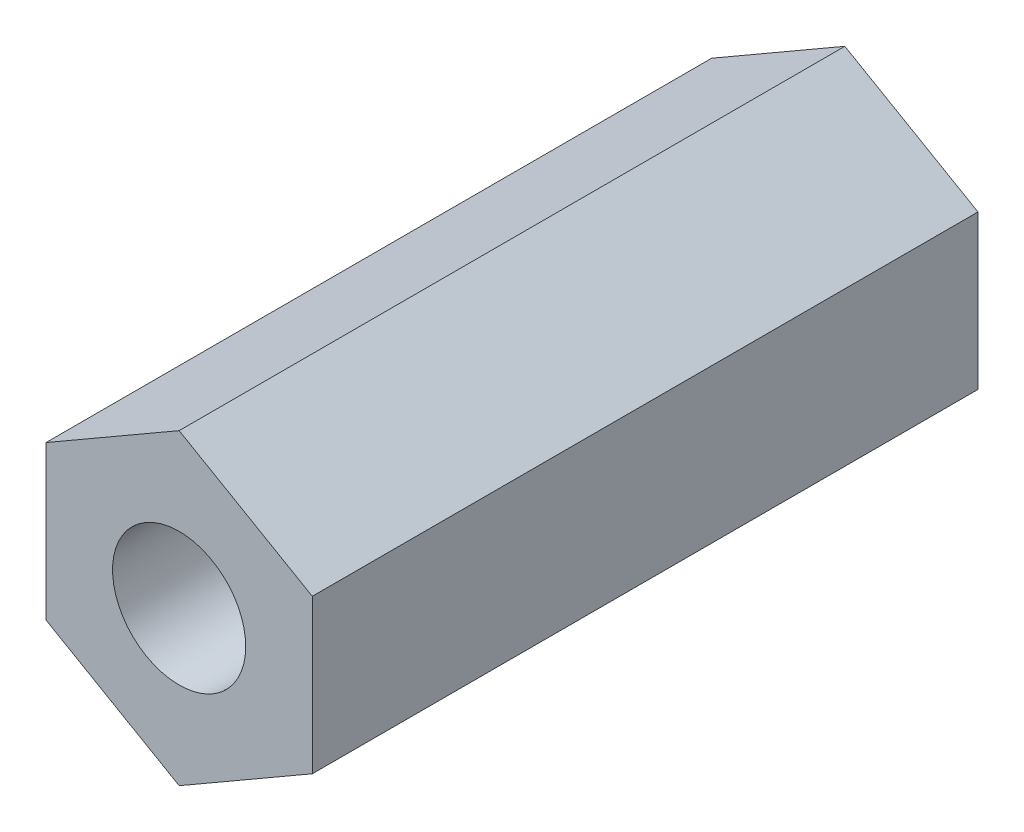
ISO-10303-21;
HEADER;
FILE_DESCRIPTION(('STEP AP214'),'2;1');
FILE_NAME('part.step','',(''),(''),'','','');
FILE_SCHEMA(('AUTOMOTIVE_DESIGN { 1 0 10303 214 1 1 1 1 }'));
ENDSEC;
DATA;
#1=APPLICATION_CONTEXT('core data for automotive mechanical design processes');
#2=APPLICATION_PROTOCOL_DEFINITION('international standard','automotive_design',2000,#1);
#3=PRODUCT_CONTEXT('',#1,'mechanical');
#4=PRODUCT('Part','Part','',(#3));
#5=PRODUCT_RELATED_PRODUCT_CATEGORY('part','',(#4));
#6=PRODUCT_DEFINITION_FORMATION('','',#4);
#7=PRODUCT_DEFINITION_CONTEXT('part definition',#1,'design');
#8=PRODUCT_DEFINITION('design','',#6,#7);
#9=PRODUCT_DEFINITION_SHAPE('','',#8);
#10=(LENGTH_UNIT() NAMED_UNIT(*) SI_UNIT(.MILLI.,.METRE.));
#11=(NAMED_UNIT(*) PLANE_ANGLE_UNIT() SI_UNIT($,.RADIAN.));
#12=(NAMED_UNIT(*) SI_UNIT($,.STERADIAN.) SOLID_ANGLE_UNIT());
#13=UNCERTAINTY_MEASURE_WITH_UNIT(LENGTH_MEASURE(1.E-05),#10,'distance_accuracy_value','');
#14=(GEOMETRIC_REPRESENTATION_CONTEXT(3) GLOBAL_UNCERTAINTY_ASSIGNED_CONTEXT((#13)) GLOBAL_UNIT_ASSIGNED_CONTEXT((#10,
#11,#12)) REPRESENTATION_CONTEXT('',''));
#15=CARTESIAN_POINT('',(0.,0.,0.));
#16=DIRECTION('',(0.,0.,1.));
#17=DIRECTION('',(1.,0.,0.));
#18=AXIS2_PLACEMENT_3D('',#15,#16,#17);
#19=CARTESIAN_POINT('',(-3.,-1.73205080756888,15.));
#20=DIRECTION('',(0.5,0.866025403784439,0.));
#21=DIRECTION('',(-0.866025403784439,0.5,0.));
#22=AXIS2_PLACEMENT_3D('',#19,#20,#21);
#23=PLANE('',#22);
#24=DIRECTION('',(0.866025403784439,-0.5,0.));
#25=VECTOR('',#24,1.);
#26=CARTESIAN_POINT('',(-3.,-1.73205080756888,0.));
#27=LINE('',#26,#25);
#28=CARTESIAN_POINT('',(-3.,-1.73205080756888,0.));
#29=VERTEX_POINT('',#28);
#30=CARTESIAN_POINT('',(0.,-3.46410161513775,0.));
#31=VERTEX_POINT('',#30);
#32=EDGE_CURVE('E117',#29,#31,#27,.T.);
#33=ORIENTED_EDGE('',*,*,#32,.T.);
#34=DIRECTION('',(0.,0.,-1.));
#35=VECTOR('',#34,1.);
#36=CARTESIAN_POINT('',(0.,-3.46410161513775,15.));
#37=LINE('',#36,#35);
#38=CARTESIAN_POINT('',(0.,-3.46410161513775,15.));
#39=VERTEX_POINT('',#38);
#40=EDGE_CURVE('E11',#39,#31,#37,.T.);
#41=ORIENTED_EDGE('',*,*,#40,.F.);
#42=DIRECTION('',(0.866025403784439,-0.5,0.));
#43=VECTOR('',#42,1.);
#44=CARTESIAN_POINT('',(-3.,-1.73205080756888,15.));
#45=LINE('',#44,#43);
#46=CARTESIAN_POINT('',(-3.,-1.73205080756888,15.));
#47=VERTEX_POINT('',#46);
#48=EDGE_CURVE('E128',#47,#39,#45,.T.);
#49=ORIENTED_EDGE('',*,*,#48,.F.);
#50=DIRECTION('',(0.,0.,-1.));
#51=VECTOR('',#50,1.);
#52=CARTESIAN_POINT('',(-3.,-1.73205080756888,15.));
#53=LINE('',#52,#51);
#54=EDGE_CURVE('E113',#47,#29,#53,.T.);
#55=ORIENTED_EDGE('',*,*,#54,.T.);
#56=EDGE_LOOP('',(#33,#41,#49,#55));
#57=FACE_BOUND('',#56,.T.);
#58=ADVANCED_FACE('F33',(#57),#23,.F.);
#59=CARTESIAN_POINT('',(0.,-3.46410161513775,15.));
#60=DIRECTION('',(-0.5,0.866025403784439,0.));
#61=DIRECTION('',(-0.866025403784439,-0.5,0.));
#62=AXIS2_PLACEMENT_3D('',#59,#60,#61);
#63=PLANE('',#62);
#64=DIRECTION('',(0.866025403784439,0.5,0.));
#65=VECTOR('',#64,1.);
#66=CARTESIAN_POINT('',(0.,-3.46410161513775,0.));
#67=LINE('',#66,#65);
#68=CARTESIAN_POINT('',(3.,-1.73205080756888,0.));
#69=VERTEX_POINT('',#68);
#70=EDGE_CURVE('E120',#31,#69,#67,.T.);
#71=ORIENTED_EDGE('',*,*,#70,.T.);
#72=DIRECTION('',(0.,0.,-1.));
#73=VECTOR('',#72,1.);
#74=CARTESIAN_POINT('',(3.,-1.73205080756888,15.));
#75=LINE('',#74,#73);
#76=CARTESIAN_POINT('',(3.,-1.73205080756888,15.));
#77=VERTEX_POINT('',#76);
#78=EDGE_CURVE('E41',#77,#69,#75,.T.);
#79=ORIENTED_EDGE('',*,*,#78,.F.);
#80=DIRECTION('',(0.866025403784439,0.5,0.));
#81=VECTOR('',#80,1.);
#82=CARTESIAN_POINT('',(0.,-3.46410161513775,15.));
#83=LINE('',#82,#81);
#84=EDGE_CURVE('E86',#39,#77,#83,.T.);
#85=ORIENTED_EDGE('',*,*,#84,.F.);
#86=ORIENTED_EDGE('',*,*,#40,.T.);
#87=EDGE_LOOP('',(#71,#79,#85,#86));
#88=FACE_BOUND('',#87,.T.);
#89=ADVANCED_FACE('F153',(#88),#63,.F.);
#90=CARTESIAN_POINT('',(3.,-1.73205080756888,15.));
#91=DIRECTION('',(-1.,0.,0.));
#92=DIRECTION('',(0.,-1.,0.));
#93=AXIS2_PLACEMENT_3D('',#90,#91,#92);
#94=PLANE('',#93);
#95=DIRECTION('',(0.,1.,0.));
#96=VECTOR('',#95,1.);
#97=CARTESIAN_POINT('',(3.,-1.73205080756888,0.));
#98=LINE('',#97,#96);
#99=CARTESIAN_POINT('',(3.,1.73205080756888,0.));
#100=VERTEX_POINT('',#99);
#101=EDGE_CURVE('E123',#69,#100,#98,.T.);
#102=ORIENTED_EDGE('',*,*,#101,.T.);
#103=DIRECTION('',(0.,0.,-1.));
#104=VECTOR('',#103,1.);
#105=CARTESIAN_POINT('',(3.,1.73205080756888,15.));
#106=LINE('',#105,#104);
#107=CARTESIAN_POINT('',(3.,1.73205080756888,15.));
#108=VERTEX_POINT('',#107);
#109=EDGE_CURVE('E108',#108,#100,#106,.T.);
#110=ORIENTED_EDGE('',*,*,#109,.F.);
#111=DIRECTION('',(0.,1.,0.));
#112=VECTOR('',#111,1.);
#113=CARTESIAN_POINT('',(3.,-1.73205080756888,15.));
#114=LINE('',#113,#112);
#115=EDGE_CURVE('E99',#77,#108,#114,.T.);
#116=ORIENTED_EDGE('',*,*,#115,.F.);
#117=ORIENTED_EDGE('',*,*,#78,.T.);
#118=EDGE_LOOP('',(#102,#110,#116,#117));
#119=FACE_BOUND('',#118,.T.);
#120=ADVANCED_FACE('F134',(#119),#94,.F.);
#121=CARTESIAN_POINT('',(3.,1.73205080756888,15.));
#122=DIRECTION('',(-0.5,-0.866025403784439,0.));
#123=DIRECTION('',(0.866025403784439,-0.5,0.));
#124=AXIS2_PLACEMENT_3D('',#121,#122,#123);
#125=PLANE('',#124);
#126=DIRECTION('',(-0.866025403784439,0.5,0.));
#127=VECTOR('',#126,1.);
#128=CARTESIAN_POINT('',(3.,1.73205080756888,0.));
#129=LINE('',#128,#127);
#130=CARTESIAN_POINT('',(0.,3.46410161513776,0.));
#131=VERTEX_POINT('',#130);
#132=EDGE_CURVE('E107',#100,#131,#129,.T.);
#133=ORIENTED_EDGE('',*,*,#132,.T.);
#134=DIRECTION('',(0.,0.,-1.));
#135=VECTOR('',#134,1.);
#136=CARTESIAN_POINT('',(0.,3.46410161513776,15.));
#137=LINE('',#136,#135);
#138=CARTESIAN_POINT('',(0.,3.46410161513776,15.));
#139=VERTEX_POINT('',#138);
#140=EDGE_CURVE('E104',#139,#131,#137,.T.);
#141=ORIENTED_EDGE('',*,*,#140,.F.);
#142=DIRECTION('',(-0.866025403784439,0.5,0.));
#143=VECTOR('',#142,1.);
#144=CARTESIAN_POINT('',(3.,1.73205080756888,15.));
#145=LINE('',#144,#143);
#146=EDGE_CURVE('E93',#108,#139,#145,.T.);
#147=ORIENTED_EDGE('',*,*,#146,.F.);
#148=ORIENTED_EDGE('',*,*,#109,.T.);
#149=EDGE_LOOP('',(#133,#141,#147,#148));
#150=FACE_BOUND('',#149,.T.);
#151=ADVANCED_FACE('F105',(#150),#125,.F.);
#152=CARTESIAN_POINT('',(0.,3.46410161513776,15.));
#153=DIRECTION('',(0.499999999999999,-0.866025403784439,0.));
#154=DIRECTION('',(0.866025403784439,0.499999999999999,0.));
#155=AXIS2_PLACEMENT_3D('',#152,#153,#154);
#156=PLANE('',#155);
#157=DIRECTION('',(-0.866025403784439,-0.499999999999999,0.));
#158=VECTOR('',#157,1.);
#159=CARTESIAN_POINT('',(0.,3.46410161513776,0.));
#160=LINE('',#159,#158);
#161=CARTESIAN_POINT('',(-3.,1.73205080756888,0.));
#162=VERTEX_POINT('',#161);
#163=EDGE_CURVE('E72',#131,#162,#160,.T.);
#164=ORIENTED_EDGE('',*,*,#163,.T.);
#165=DIRECTION('',(0.,0.,-1.));
#166=VECTOR('',#165,1.);
#167=CARTESIAN_POINT('',(-3.,1.73205080756888,15.));
#168=LINE('',#167,#166);
#169=CARTESIAN_POINT('',(-3.,1.73205080756888,15.));
#170=VERTEX_POINT('',#169);
#171=EDGE_CURVE('E109',#170,#162,#168,.T.);
#172=ORIENTED_EDGE('',*,*,#171,.F.);
#173=DIRECTION('',(-0.866025403784439,-0.499999999999999,0.));
#174=VECTOR('',#173,1.);
#175=CARTESIAN_POINT('',(0.,3.46410161513776,15.));
#176=LINE('',#175,#174);
#177=EDGE_CURVE('E97',#139,#170,#176,.T.);
#178=ORIENTED_EDGE('',*,*,#177,.F.);
#179=ORIENTED_EDGE('',*,*,#140,.T.);
#180=EDGE_LOOP('',(#164,#172,#178,#179));
#181=FACE_BOUND('',#180,.T.);
#182=ADVANCED_FACE('F111',(#181),#156,.F.);
#183=CARTESIAN_POINT('',(-3.,1.73205080756888,15.));
#184=DIRECTION('',(1.,0.,0.));
#185=DIRECTION('',(0.,1.,0.));
#186=AXIS2_PLACEMENT_3D('',#183,#184,#185);
#187=PLANE('',#186);
#188=DIRECTION('',(0.,-1.,0.));
#189=VECTOR('',#188,1.);
#190=CARTESIAN_POINT('',(-3.,1.73205080756888,0.));
#191=LINE('',#190,#189);
#192=EDGE_CURVE('E78',#162,#29,#191,.T.);
#193=ORIENTED_EDGE('',*,*,#192,.T.);
#194=ORIENTED_EDGE('',*,*,#54,.F.);
#195=DIRECTION('',(0.,-1.,0.));
#196=VECTOR('',#195,1.);
#197=CARTESIAN_POINT('',(-3.,1.73205080756888,15.));
#198=LINE('',#197,#196);
#199=EDGE_CURVE('E49',#170,#47,#198,.T.);
#200=ORIENTED_EDGE('',*,*,#199,.F.);
#201=ORIENTED_EDGE('',*,*,#171,.T.);
#202=EDGE_LOOP('',(#193,#194,#200,#201));
#203=FACE_BOUND('',#202,.T.);
#204=ADVANCED_FACE('F141',(#203),#187,.F.);
#205=CARTESIAN_POINT('',(0.,0.,15.));
#206=DIRECTION('',(0.,0.,1.));
#207=DIRECTION('',(1.,0.,0.));
#208=AXIS2_PLACEMENT_3D('',#205,#206,#207);
#209=PLANE('',#208);
#210=CARTESIAN_POINT('',(0.,0.,15.));
#211=DIRECTION('',(0.,0.,1.));
#212=DIRECTION('',(1.,0.,0.));
#213=AXIS2_PLACEMENT_3D('',#210,#211,#212);
#214=CIRCLE('',#213,1.5);
#215=CARTESIAN_POINT('',(1.5,0.,15.));
#216=VERTEX_POINT('',#215);
#217=EDGE_CURVE('E237',#216,#216,#214,.T.);
#218=ORIENTED_EDGE('',*,*,#217,.F.);
#219=EDGE_LOOP('',(#218));
#220=FACE_BOUND('',#219,.T.);
#221=ORIENTED_EDGE('',*,*,#48,.T.);
#222=ORIENTED_EDGE('',*,*,#84,.T.);
#223=ORIENTED_EDGE('',*,*,#115,.T.);
#224=ORIENTED_EDGE('',*,*,#146,.T.);
#225=ORIENTED_EDGE('',*,*,#177,.T.);
#226=ORIENTED_EDGE('',*,*,#199,.T.);
#227=EDGE_LOOP('',(#221,#222,#223,#224,#225,#226));
#228=FACE_BOUND('',#227,.T.);
#229=ADVANCED_FACE('F95',(#220,#228),#209,.T.);
#230=CARTESIAN_POINT('',(0.,0.,0.));
#231=DIRECTION('',(0.,0.,1.));
#232=DIRECTION('',(1.,0.,0.));
#233=AXIS2_PLACEMENT_3D('',#230,#231,#232);
#234=PLANE('',#233);
#235=CARTESIAN_POINT('',(0.,0.,0.));
#236=DIRECTION('',(0.,0.,-1.));
#237=DIRECTION('',(-1.,0.,0.));
#238=AXIS2_PLACEMENT_3D('',#235,#236,#237);
#239=CIRCLE('',#238,1.5);
#240=CARTESIAN_POINT('',(-1.5,0.,0.));
#241=VERTEX_POINT('',#240);
#242=EDGE_CURVE('E236',#241,#241,#239,.T.);
#243=ORIENTED_EDGE('',*,*,#242,.F.);
#244=EDGE_LOOP('',(#243));
#245=FACE_BOUND('',#244,.T.);
#246=ORIENTED_EDGE('',*,*,#32,.F.);
#247=ORIENTED_EDGE('',*,*,#192,.F.);
#248=ORIENTED_EDGE('',*,*,#163,.F.);
#249=ORIENTED_EDGE('',*,*,#132,.F.);
#250=ORIENTED_EDGE('',*,*,#101,.F.);
#251=ORIENTED_EDGE('',*,*,#70,.F.);
#252=EDGE_LOOP('',(#246,#247,#248,#249,#250,#251));
#253=FACE_BOUND('',#252,.T.);
#254=ADVANCED_FACE('F137',(#245,#253),#234,.F.);
#255=CARTESIAN_POINT('',(0.,0.,5.));
#256=DIRECTION('',(0.,0.,-1.));
#257=DIRECTION('',(-1.,0.,0.));
#258=AXIS2_PLACEMENT_3D('',#255,#256,#257);
#259=CYLINDRICAL_SURFACE('',#258,1.5);
#260=CARTESIAN_POINT('',(0.,0.,5.));
#261=DIRECTION('',(0.,0.,-1.));
#262=DIRECTION('',(-1.,0.,0.));
#263=AXIS2_PLACEMENT_3D('',#260,#261,#262);
#264=CIRCLE('',#263,1.5);
#265=CARTESIAN_POINT('',(-1.5,0.,5.));
#266=VERTEX_POINT('',#265);
#267=EDGE_CURVE('E121',#266,#266,#264,.T.);
#268=ORIENTED_EDGE('',*,*,#267,.F.);
#269=EDGE_LOOP('',(#268));
#270=FACE_BOUND('',#269,.T.);
#271=ORIENTED_EDGE('',*,*,#242,.T.);
#272=EDGE_LOOP('',(#271));
#273=FACE_BOUND('',#272,.T.);
#274=ADVANCED_FACE('F185',(#270,#273),#259,.F.);
#275=CARTESIAN_POINT('',(0.,0.,5.));
#276=DIRECTION('',(0.,0.,-1.));
#277=DIRECTION('',(-1.,0.,0.));
#278=AXIS2_PLACEMENT_3D('',#275,#276,#277);
#279=PLANE('',#278);
#280=ORIENTED_EDGE('',*,*,#267,.T.);
#281=EDGE_LOOP('',(#280));
#282=FACE_BOUND('',#281,.T.);
#283=ADVANCED_FACE('F194',(#282),#279,.T.);
#284=CARTESIAN_POINT('',(0.,0.,10.));
#285=DIRECTION('',(0.,0.,1.));
#286=DIRECTION('',(1.,0.,0.));
#287=AXIS2_PLACEMENT_3D('',#284,#285,#286);
#288=CYLINDRICAL_SURFACE('',#287,1.5);
#289=CARTESIAN_POINT('',(0.,0.,10.));
#290=DIRECTION('',(0.,0.,1.));
#291=DIRECTION('',(1.,0.,0.));
#292=AXIS2_PLACEMENT_3D('',#289,#290,#291);
#293=CIRCLE('',#292,1.5);
#294=CARTESIAN_POINT('',(1.5,0.,10.));
#295=VERTEX_POINT('',#294);
#296=EDGE_CURVE('E235',#295,#295,#293,.T.);
#297=ORIENTED_EDGE('',*,*,#296,.F.);
#298=EDGE_LOOP('',(#297));
#299=FACE_BOUND('',#298,.T.);
#300=ORIENTED_EDGE('',*,*,#217,.T.);
#301=EDGE_LOOP('',(#300));
#302=FACE_BOUND('',#301,.T.);
#303=ADVANCED_FACE('F204',(#299,#302),#288,.F.);
#304=CARTESIAN_POINT('',(0.,0.,10.));
#305=DIRECTION('',(0.,0.,1.));
#306=DIRECTION('',(1.,0.,0.));
#307=AXIS2_PLACEMENT_3D('',#304,#305,#306);
#308=PLANE('',#307);
#309=ORIENTED_EDGE('',*,*,#296,.T.);
#310=EDGE_LOOP('',(#309));
#311=FACE_BOUND('',#310,.T.);
#312=ADVANCED_FACE('F219',(#311),#308,.T.);
#313=CLOSED_SHELL('',(#58,#89,#120,#151,#182,#204,#229,#254,#274,#283,#303,#312));
#314=MANIFOLD_SOLID_BREP('B2',#313);
#315=ADVANCED_BREP_SHAPE_REPRESENTATION('',(#18,#314),#14);
#316=SHAPE_DEFINITION_REPRESENTATION(#9,#315);
ENDSEC;
END-ISO-10303-21;
